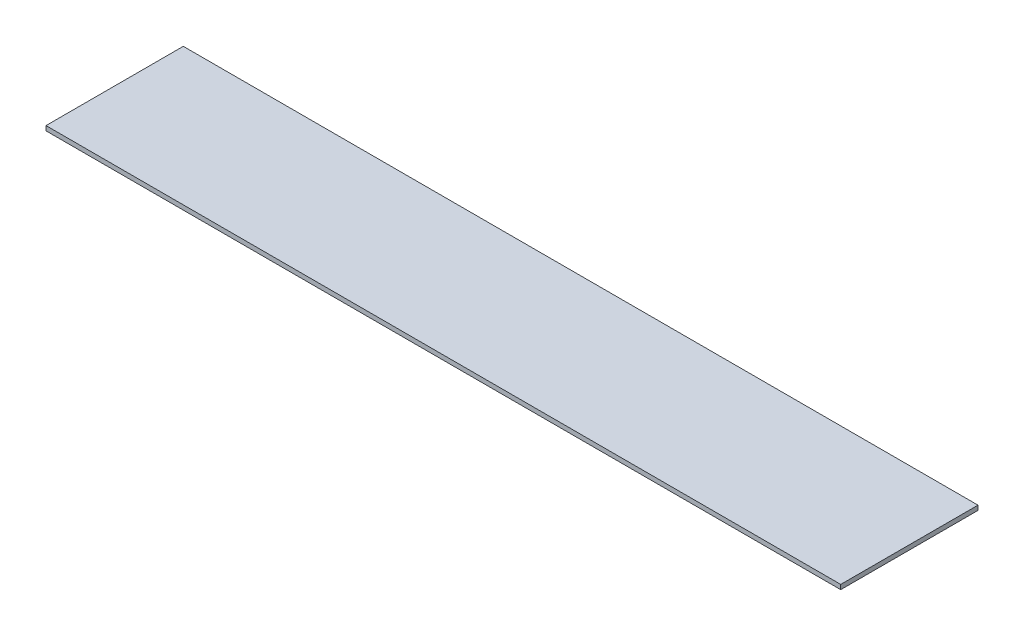
ISO-10303-21;
HEADER;
FILE_DESCRIPTION(('STEP AP214'),'2;1');
FILE_NAME('part.step','',(''),(''),'','','');
FILE_SCHEMA(('AUTOMOTIVE_DESIGN { 1 0 10303 214 1 1 1 1 }'));
ENDSEC;
DATA;
#1=APPLICATION_CONTEXT('core data for automotive mechanical design processes');
#2=APPLICATION_PROTOCOL_DEFINITION('international standard','automotive_design',2000,#1);
#3=PRODUCT_CONTEXT('',#1,'mechanical');
#4=PRODUCT('Part','Part','',(#3));
#5=PRODUCT_RELATED_PRODUCT_CATEGORY('part','',(#4));
#6=PRODUCT_DEFINITION_FORMATION('','',#4);
#7=PRODUCT_DEFINITION_CONTEXT('part definition',#1,'design');
#8=PRODUCT_DEFINITION('design','',#6,#7);
#9=PRODUCT_DEFINITION_SHAPE('','',#8);
#10=(LENGTH_UNIT() NAMED_UNIT(*) SI_UNIT(.MILLI.,.METRE.));
#11=(NAMED_UNIT(*) PLANE_ANGLE_UNIT() SI_UNIT($,.RADIAN.));
#12=(NAMED_UNIT(*) SI_UNIT($,.STERADIAN.) SOLID_ANGLE_UNIT());
#13=UNCERTAINTY_MEASURE_WITH_UNIT(LENGTH_MEASURE(1.E-05),#10,'distance_accuracy_value','');
#14=(GEOMETRIC_REPRESENTATION_CONTEXT(3) GLOBAL_UNCERTAINTY_ASSIGNED_CONTEXT((#13)) GLOBAL_UNIT_ASSIGNED_CONTEXT((#10,
#11,#12)) REPRESENTATION_CONTEXT('',''));
#15=CARTESIAN_POINT('',(0.,0.,0.));
#16=DIRECTION('',(0.,0.,1.));
#17=DIRECTION('',(1.,0.,0.));
#18=AXIS2_PLACEMENT_3D('',#15,#16,#17);
#19=CARTESIAN_POINT('',(-260.5,0.,-90.));
#20=DIRECTION('',(0.,-1.,0.));
#21=DIRECTION('',(0.,0.,-1.));
#22=AXIS2_PLACEMENT_3D('',#19,#20,#21);
#23=PLANE('',#22);
#24=DIRECTION('',(1.,0.,0.));
#25=VECTOR('',#24,1.);
#26=CARTESIAN_POINT('',(-260.5,0.,0.));
#27=LINE('',#26,#25);
#28=CARTESIAN_POINT('',(-260.5,0.,0.));
#29=VERTEX_POINT('',#28);
#30=CARTESIAN_POINT('',(260.5,0.,0.));
#31=VERTEX_POINT('',#30);
#32=EDGE_CURVE('E101',#29,#31,#27,.T.);
#33=ORIENTED_EDGE('',*,*,#32,.F.);
#34=DIRECTION('',(0.,0.,1.));
#35=VECTOR('',#34,1.);
#36=CARTESIAN_POINT('',(-260.5,0.,-90.));
#37=LINE('',#36,#35);
#38=CARTESIAN_POINT('',(-260.5,0.,-90.));
#39=VERTEX_POINT('',#38);
#40=EDGE_CURVE('E11',#39,#29,#37,.T.);
#41=ORIENTED_EDGE('',*,*,#40,.F.);
#42=DIRECTION('',(1.,0.,0.));
#43=VECTOR('',#42,1.);
#44=CARTESIAN_POINT('',(-260.5,0.,-90.));
#45=LINE('',#44,#43);
#46=CARTESIAN_POINT('',(260.5,0.,-90.));
#47=VERTEX_POINT('',#46);
#48=EDGE_CURVE('E96',#39,#47,#45,.T.);
#49=ORIENTED_EDGE('',*,*,#48,.T.);
#50=DIRECTION('',(0.,0.,1.));
#51=VECTOR('',#50,1.);
#52=CARTESIAN_POINT('',(260.5,0.,-90.));
#53=LINE('',#52,#51);
#54=EDGE_CURVE('E39',#47,#31,#53,.T.);
#55=ORIENTED_EDGE('',*,*,#54,.T.);
#56=EDGE_LOOP('',(#33,#41,#49,#55));
#57=FACE_BOUND('',#56,.T.);
#58=ADVANCED_FACE('F36',(#57),#23,.T.);
#59=CARTESIAN_POINT('',(-260.5,0.,-90.));
#60=DIRECTION('',(1.,0.,0.));
#61=DIRECTION('',(0.,0.,-1.));
#62=AXIS2_PLACEMENT_3D('',#59,#60,#61);
#63=PLANE('',#62);
#64=DIRECTION('',(0.,1.,0.));
#65=VECTOR('',#64,1.);
#66=CARTESIAN_POINT('',(-260.5,0.,0.));
#67=LINE('',#66,#65);
#68=CARTESIAN_POINT('',(-260.5,3.,0.));
#69=VERTEX_POINT('',#68);
#70=EDGE_CURVE('E69',#29,#69,#67,.T.);
#71=ORIENTED_EDGE('',*,*,#70,.T.);
#72=DIRECTION('',(0.,0.,1.));
#73=VECTOR('',#72,1.);
#74=CARTESIAN_POINT('',(-260.5,3.,-90.));
#75=LINE('',#74,#73);
#76=CARTESIAN_POINT('',(-260.5,3.,-90.));
#77=VERTEX_POINT('',#76);
#78=EDGE_CURVE('E45',#77,#69,#75,.T.);
#79=ORIENTED_EDGE('',*,*,#78,.F.);
#80=DIRECTION('',(0.,1.,0.));
#81=VECTOR('',#80,1.);
#82=CARTESIAN_POINT('',(-260.5,0.,-90.));
#83=LINE('',#82,#81);
#84=EDGE_CURVE('E84',#39,#77,#83,.T.);
#85=ORIENTED_EDGE('',*,*,#84,.F.);
#86=ORIENTED_EDGE('',*,*,#40,.T.);
#87=EDGE_LOOP('',(#71,#79,#85,#86));
#88=FACE_BOUND('',#87,.T.);
#89=ADVANCED_FACE('F111',(#88),#63,.F.);
#90=CARTESIAN_POINT('',(-260.5,3.,-90.));
#91=DIRECTION('',(0.,-1.,0.));
#92=DIRECTION('',(0.,0.,-1.));
#93=AXIS2_PLACEMENT_3D('',#90,#91,#92);
#94=PLANE('',#93);
#95=DIRECTION('',(1.,0.,0.));
#96=VECTOR('',#95,1.);
#97=CARTESIAN_POINT('',(-260.5,3.,0.));
#98=LINE('',#97,#96);
#99=CARTESIAN_POINT('',(260.5,3.,0.));
#100=VERTEX_POINT('',#99);
#101=EDGE_CURVE('E91',#69,#100,#98,.T.);
#102=ORIENTED_EDGE('',*,*,#101,.T.);
#103=DIRECTION('',(0.,0.,1.));
#104=VECTOR('',#103,1.);
#105=CARTESIAN_POINT('',(260.5,3.,-90.));
#106=LINE('',#105,#104);
#107=CARTESIAN_POINT('',(260.5,3.,-90.));
#108=VERTEX_POINT('',#107);
#109=EDGE_CURVE('E88',#108,#100,#106,.T.);
#110=ORIENTED_EDGE('',*,*,#109,.F.);
#111=DIRECTION('',(1.,0.,0.));
#112=VECTOR('',#111,1.);
#113=CARTESIAN_POINT('',(-260.5,3.,-90.));
#114=LINE('',#113,#112);
#115=EDGE_CURVE('E81',#77,#108,#114,.T.);
#116=ORIENTED_EDGE('',*,*,#115,.F.);
#117=ORIENTED_EDGE('',*,*,#78,.T.);
#118=EDGE_LOOP('',(#102,#110,#116,#117));
#119=FACE_BOUND('',#118,.T.);
#120=ADVANCED_FACE('F89',(#119),#94,.F.);
#121=CARTESIAN_POINT('',(260.5,3.,-90.));
#122=DIRECTION('',(-1.,0.,0.));
#123=DIRECTION('',(0.,0.,1.));
#124=AXIS2_PLACEMENT_3D('',#121,#122,#123);
#125=PLANE('',#124);
#126=DIRECTION('',(0.,-1.,0.));
#127=VECTOR('',#126,1.);
#128=CARTESIAN_POINT('',(260.5,3.,0.));
#129=LINE('',#128,#127);
#130=EDGE_CURVE('E104',#100,#31,#129,.T.);
#131=ORIENTED_EDGE('',*,*,#130,.T.);
#132=ORIENTED_EDGE('',*,*,#54,.F.);
#133=DIRECTION('',(0.,-1.,0.));
#134=VECTOR('',#133,1.);
#135=CARTESIAN_POINT('',(260.5,3.,-90.));
#136=LINE('',#135,#134);
#137=EDGE_CURVE('E78',#108,#47,#136,.T.);
#138=ORIENTED_EDGE('',*,*,#137,.F.);
#139=ORIENTED_EDGE('',*,*,#109,.T.);
#140=EDGE_LOOP('',(#131,#132,#138,#139));
#141=FACE_BOUND('',#140,.T.);
#142=ADVANCED_FACE('F95',(#141),#125,.F.);
#143=CARTESIAN_POINT('',(0.,0.,-90.));
#144=DIRECTION('',(0.,0.,-1.));
#145=DIRECTION('',(-1.,0.,0.));
#146=AXIS2_PLACEMENT_3D('',#143,#144,#145);
#147=PLANE('',#146);
#148=ORIENTED_EDGE('',*,*,#48,.F.);
#149=ORIENTED_EDGE('',*,*,#84,.T.);
#150=ORIENTED_EDGE('',*,*,#115,.T.);
#151=ORIENTED_EDGE('',*,*,#137,.T.);
#152=EDGE_LOOP('',(#148,#149,#150,#151));
#153=FACE_BOUND('',#152,.T.);
#154=ADVANCED_FACE('F83',(#153),#147,.T.);
#155=CARTESIAN_POINT('',(0.,0.,0.));
#156=DIRECTION('',(0.,0.,-1.));
#157=DIRECTION('',(-1.,0.,0.));
#158=AXIS2_PLACEMENT_3D('',#155,#156,#157);
#159=PLANE('',#158);
#160=ORIENTED_EDGE('',*,*,#32,.T.);
#161=ORIENTED_EDGE('',*,*,#130,.F.);
#162=ORIENTED_EDGE('',*,*,#101,.F.);
#163=ORIENTED_EDGE('',*,*,#70,.F.);
#164=EDGE_LOOP('',(#160,#161,#162,#163));
#165=FACE_BOUND('',#164,.T.);
#166=ADVANCED_FACE('F109',(#165),#159,.F.);
#167=CLOSED_SHELL('',(#58,#89,#120,#142,#154,#166));
#168=MANIFOLD_SOLID_BREP('B2',#167);
#169=ADVANCED_BREP_SHAPE_REPRESENTATION('',(#18,#168),#14);
#170=SHAPE_DEFINITION_REPRESENTATION(#9,#169);
ENDSEC;
END-ISO-10303-21;
